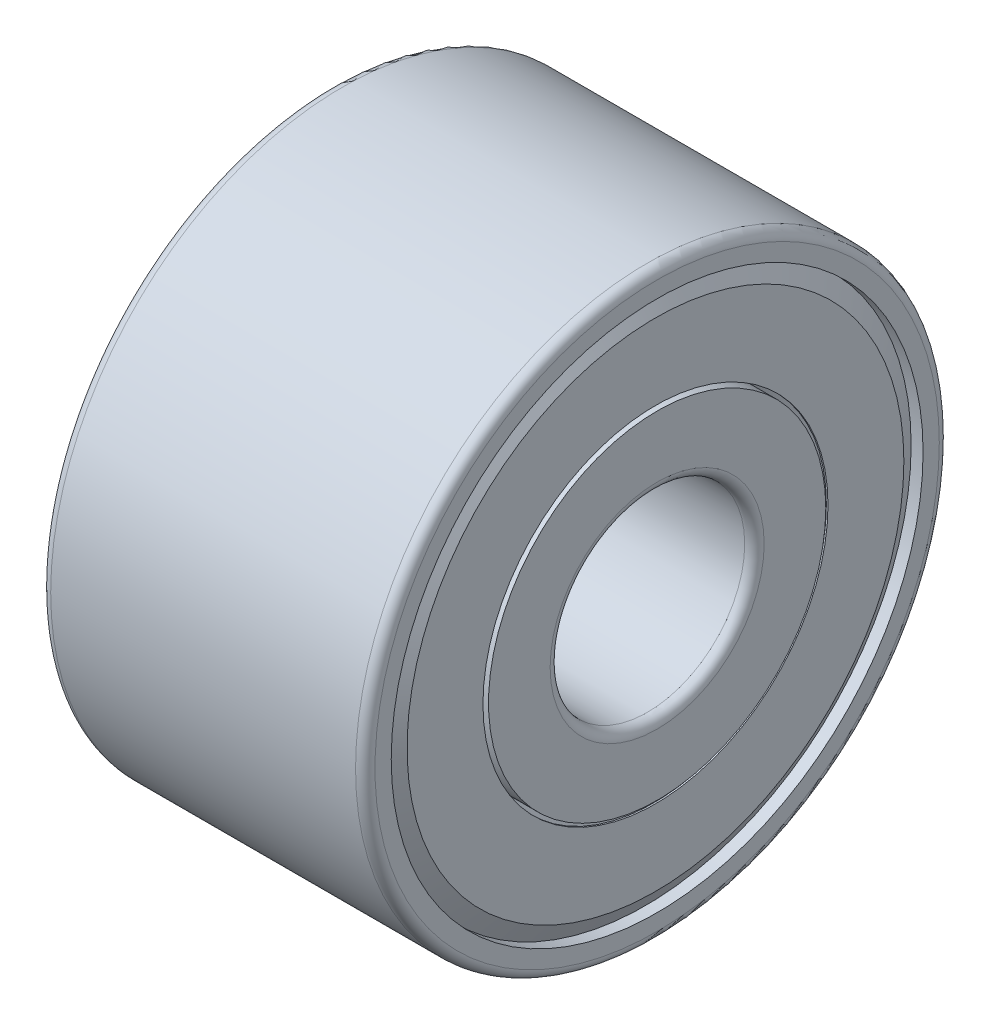
ISO-10303-21;
HEADER;
FILE_DESCRIPTION(('STEP AP214'),'2;1');
FILE_NAME('part.step','',(''),(''),'','','');
FILE_SCHEMA(('AUTOMOTIVE_DESIGN { 1 0 10303 214 1 1 1 1 }'));
ENDSEC;
DATA;
#1=APPLICATION_CONTEXT('core data for automotive mechanical design processes');
#2=APPLICATION_PROTOCOL_DEFINITION('international standard','automotive_design',2000,#1);
#3=PRODUCT_CONTEXT('',#1,'mechanical');
#4=PRODUCT('Part','Part','',(#3));
#5=PRODUCT_RELATED_PRODUCT_CATEGORY('part','',(#4));
#6=PRODUCT_DEFINITION_FORMATION('','',#4);
#7=PRODUCT_DEFINITION_CONTEXT('part definition',#1,'design');
#8=PRODUCT_DEFINITION('design','',#6,#7);
#9=PRODUCT_DEFINITION_SHAPE('','',#8);
#10=(LENGTH_UNIT() NAMED_UNIT(*) SI_UNIT(.MILLI.,.METRE.));
#11=(NAMED_UNIT(*) PLANE_ANGLE_UNIT() SI_UNIT($,.RADIAN.));
#12=(NAMED_UNIT(*) SI_UNIT($,.STERADIAN.) SOLID_ANGLE_UNIT());
#13=UNCERTAINTY_MEASURE_WITH_UNIT(LENGTH_MEASURE(1.E-05),#10,'distance_accuracy_value','');
#14=(GEOMETRIC_REPRESENTATION_CONTEXT(3) GLOBAL_UNCERTAINTY_ASSIGNED_CONTEXT((#13)) GLOBAL_UNIT_ASSIGNED_CONTEXT((#10,
#11,#12)) REPRESENTATION_CONTEXT('',''));
#15=CARTESIAN_POINT('',(0.,0.,0.));
#16=DIRECTION('',(0.,0.,1.));
#17=DIRECTION('',(1.,0.,0.));
#18=AXIS2_PLACEMENT_3D('',#15,#16,#17);
#19=CARTESIAN_POINT('',(4.,0.,0.));
#20=DIRECTION('',(-1.,0.,0.));
#21=DIRECTION('',(0.,0.,-1.));
#22=AXIS2_PLACEMENT_3D('',#19,#20,#21);
#23=CYLINDRICAL_SURFACE('',#22,2.6);
#24=CARTESIAN_POINT('',(4.,0.,0.));
#25=DIRECTION('',(1.,0.,0.));
#26=DIRECTION('',(0.,0.,-1.));
#27=AXIS2_PLACEMENT_3D('',#24,#25,#26);
#28=CIRCLE('',#27,2.6);
#29=CARTESIAN_POINT('',(4.,0.,-2.6));
#30=VERTEX_POINT('',#29);
#31=EDGE_CURVE('E10',#30,#30,#28,.T.);
#32=ORIENTED_EDGE('',*,*,#31,.F.);
#33=EDGE_LOOP('',(#32));
#34=FACE_BOUND('',#33,.T.);
#35=CARTESIAN_POINT('',(3.11246098558306,0.,0.));
#36=DIRECTION('',(1.,0.,0.));
#37=DIRECTION('',(0.,0.,-1.));
#38=AXIS2_PLACEMENT_3D('',#35,#36,#37);
#39=CIRCLE('',#38,2.6);
#40=CARTESIAN_POINT('',(3.11246098558306,0.,-2.6));
#41=VERTEX_POINT('',#40);
#42=EDGE_CURVE('E141',#41,#41,#39,.T.);
#43=ORIENTED_EDGE('',*,*,#42,.T.);
#44=EDGE_LOOP('',(#43));
#45=FACE_BOUND('',#44,.T.);
#46=ADVANCED_FACE('F35',(#34,#45),#23,.T.);
#47=CARTESIAN_POINT('',(4.,2.6,0.));
#48=DIRECTION('',(1.,0.,0.));
#49=DIRECTION('',(0.,0.,1.));
#50=AXIS2_PLACEMENT_3D('',#47,#48,#49);
#51=PLANE('',#50);
#52=CARTESIAN_POINT('',(4.,0.,0.));
#53=DIRECTION('',(1.,0.,0.));
#54=DIRECTION('',(0.,0.,-1.));
#55=AXIS2_PLACEMENT_3D('',#52,#53,#54);
#56=CIRCLE('',#55,1.65);
#57=CARTESIAN_POINT('',(4.,0.,-1.65));
#58=VERTEX_POINT('',#57);
#59=EDGE_CURVE('E41',#58,#58,#56,.T.);
#60=ORIENTED_EDGE('',*,*,#59,.F.);
#61=EDGE_LOOP('',(#60));
#62=FACE_BOUND('',#61,.T.);
#63=ORIENTED_EDGE('',*,*,#31,.T.);
#64=EDGE_LOOP('',(#63));
#65=FACE_BOUND('',#64,.T.);
#66=ADVANCED_FACE('F334',(#62,#65),#51,.T.);
#67=CARTESIAN_POINT('',(3.85,0.,0.));
#68=DIRECTION('',(-1.,0.,0.));
#69=DIRECTION('',(0.,0.,-1.));
#70=AXIS2_PLACEMENT_3D('',#67,#68,#69);
#71=TOROIDAL_SURFACE('',#70,1.65,0.15);
#72=CARTESIAN_POINT('',(3.85,0.,0.));
#73=DIRECTION('',(1.,0.,0.));
#74=DIRECTION('',(0.,0.,-1.));
#75=AXIS2_PLACEMENT_3D('',#72,#73,#74);
#76=CIRCLE('',#75,1.5);
#77=CARTESIAN_POINT('',(3.85,0.,-1.5));
#78=VERTEX_POINT('',#77);
#79=EDGE_CURVE('E45',#78,#78,#76,.T.);
#80=ORIENTED_EDGE('',*,*,#79,.F.);
#81=EDGE_LOOP('',(#80));
#82=FACE_BOUND('',#81,.T.);
#83=ORIENTED_EDGE('',*,*,#59,.T.);
#84=EDGE_LOOP('',(#83));
#85=FACE_BOUND('',#84,.T.);
#86=ADVANCED_FACE('F329',(#82,#85),#71,.T.);
#87=CARTESIAN_POINT('',(4.,0.,0.));
#88=DIRECTION('',(-1.,0.,0.));
#89=DIRECTION('',(0.,0.,-1.));
#90=AXIS2_PLACEMENT_3D('',#87,#88,#89);
#91=CYLINDRICAL_SURFACE('',#90,1.5);
#92=CARTESIAN_POINT('',(-0.85,0.,0.));
#93=DIRECTION('',(1.,0.,0.));
#94=DIRECTION('',(0.,0.,-1.));
#95=AXIS2_PLACEMENT_3D('',#92,#93,#94);
#96=CIRCLE('',#95,1.5);
#97=CARTESIAN_POINT('',(-0.85,0.,-1.5));
#98=VERTEX_POINT('',#97);
#99=EDGE_CURVE('E49',#98,#98,#96,.T.);
#100=ORIENTED_EDGE('',*,*,#99,.F.);
#101=EDGE_LOOP('',(#100));
#102=FACE_BOUND('',#101,.T.);
#103=ORIENTED_EDGE('',*,*,#79,.T.);
#104=EDGE_LOOP('',(#103));
#105=FACE_BOUND('',#104,.T.);
#106=ADVANCED_FACE('F323',(#102,#105),#91,.F.);
#107=CARTESIAN_POINT('',(-0.85,0.,0.));
#108=DIRECTION('',(-1.,0.,0.));
#109=DIRECTION('',(0.,0.,-1.));
#110=AXIS2_PLACEMENT_3D('',#107,#108,#109);
#111=TOROIDAL_SURFACE('',#110,1.65,0.15);
#112=CARTESIAN_POINT('',(-1.,0.,0.));
#113=DIRECTION('',(1.,0.,0.));
#114=DIRECTION('',(0.,0.,-1.));
#115=AXIS2_PLACEMENT_3D('',#112,#113,#114);
#116=CIRCLE('',#115,1.65);
#117=CARTESIAN_POINT('',(-1.,0.,-1.65));
#118=VERTEX_POINT('',#117);
#119=EDGE_CURVE('E54',#118,#118,#116,.T.);
#120=ORIENTED_EDGE('',*,*,#119,.F.);
#121=EDGE_LOOP('',(#120));
#122=FACE_BOUND('',#121,.T.);
#123=ORIENTED_EDGE('',*,*,#99,.T.);
#124=EDGE_LOOP('',(#123));
#125=FACE_BOUND('',#124,.T.);
#126=ADVANCED_FACE('F317',(#122,#125),#111,.T.);
#127=CARTESIAN_POINT('',(-1.,2.6,0.));
#128=DIRECTION('',(-1.,0.,0.));
#129=DIRECTION('',(0.,0.,-1.));
#130=AXIS2_PLACEMENT_3D('',#127,#128,#129);
#131=PLANE('',#130);
#132=CARTESIAN_POINT('',(-1.,0.,0.));
#133=DIRECTION('',(1.,0.,0.));
#134=DIRECTION('',(0.,0.,-1.));
#135=AXIS2_PLACEMENT_3D('',#132,#133,#134);
#136=CIRCLE('',#135,2.6);
#137=CARTESIAN_POINT('',(-1.,0.,-2.6));
#138=VERTEX_POINT('',#137);
#139=EDGE_CURVE('E57',#138,#138,#136,.T.);
#140=ORIENTED_EDGE('',*,*,#139,.F.);
#141=EDGE_LOOP('',(#140));
#142=FACE_BOUND('',#141,.T.);
#143=ORIENTED_EDGE('',*,*,#119,.T.);
#144=EDGE_LOOP('',(#143));
#145=FACE_BOUND('',#144,.T.);
#146=ADVANCED_FACE('F311',(#142,#145),#131,.T.);
#147=CARTESIAN_POINT('',(4.,0.,0.));
#148=DIRECTION('',(-1.,0.,0.));
#149=DIRECTION('',(0.,0.,-1.));
#150=AXIS2_PLACEMENT_3D('',#147,#148,#149);
#151=CYLINDRICAL_SURFACE('',#150,2.6);
#152=CARTESIAN_POINT('',(-0.112460985583064,0.,0.));
#153=DIRECTION('',(1.,0.,0.));
#154=DIRECTION('',(0.,0.,-1.));
#155=AXIS2_PLACEMENT_3D('',#152,#153,#154);
#156=CIRCLE('',#155,2.6);
#157=CARTESIAN_POINT('',(-0.112460985583064,0.,-2.6));
#158=VERTEX_POINT('',#157);
#159=EDGE_CURVE('E60',#158,#158,#156,.T.);
#160=ORIENTED_EDGE('',*,*,#159,.F.);
#161=EDGE_LOOP('',(#160));
#162=FACE_BOUND('',#161,.T.);
#163=ORIENTED_EDGE('',*,*,#139,.T.);
#164=EDGE_LOOP('',(#163));
#165=FACE_BOUND('',#164,.T.);
#166=ADVANCED_FACE('F305',(#162,#165),#151,.T.);
#167=CARTESIAN_POINT('',(1.,0.,0.));
#168=DIRECTION('',(-1.,0.,0.));
#169=DIRECTION('',(0.,0.,-1.));
#170=AXIS2_PLACEMENT_3D('',#167,#168,#169);
#171=TOROIDAL_SURFACE('',#170,3.35,1.34166666666667);
#172=CARTESIAN_POINT('',(-0.245017849046528,0.,0.));
#173=DIRECTION('',(1.,0.,0.));
#174=DIRECTION('',(0.,0.,-1.));
#175=AXIS2_PLACEMENT_3D('',#172,#173,#174);
#176=CIRCLE('',#175,3.85);
#177=CARTESIAN_POINT('',(-0.245017849046528,0.,-3.85));
#178=VERTEX_POINT('',#177);
#179=EDGE_CURVE('E63',#178,#178,#176,.T.);
#180=ORIENTED_EDGE('',*,*,#179,.F.);
#181=EDGE_LOOP('',(#180));
#182=FACE_BOUND('',#181,.T.);
#183=ORIENTED_EDGE('',*,*,#159,.T.);
#184=EDGE_LOOP('',(#183));
#185=FACE_BOUND('',#184,.T.);
#186=ADVANCED_FACE('F299',(#182,#185),#171,.T.);
#187=CARTESIAN_POINT('',(4.,0.,0.));
#188=DIRECTION('',(-1.,0.,0.));
#189=DIRECTION('',(0.,0.,-1.));
#190=AXIS2_PLACEMENT_3D('',#187,#188,#189);
#191=CYLINDRICAL_SURFACE('',#190,3.85);
#192=CARTESIAN_POINT('',(-0.636363636363635,0.,0.));
#193=DIRECTION('',(1.,0.,0.));
#194=DIRECTION('',(0.,0.,-1.));
#195=AXIS2_PLACEMENT_3D('',#192,#193,#194);
#196=CIRCLE('',#195,3.85);
#197=CARTESIAN_POINT('',(-0.636363636363635,0.,-3.85));
#198=VERTEX_POINT('',#197);
#199=EDGE_CURVE('E66',#198,#198,#196,.T.);
#200=ORIENTED_EDGE('',*,*,#199,.F.);
#201=EDGE_LOOP('',(#200));
#202=FACE_BOUND('',#201,.T.);
#203=ORIENTED_EDGE('',*,*,#179,.T.);
#204=EDGE_LOOP('',(#203));
#205=FACE_BOUND('',#204,.T.);
#206=ADVANCED_FACE('F293',(#202,#205),#191,.F.);
#207=CARTESIAN_POINT('',(-0.63636363636363,4.09999999999993,0.));
#208=DIRECTION('',(-1.,0.,0.));
#209=DIRECTION('',(0.,0.,-1.));
#210=AXIS2_PLACEMENT_3D('',#207,#208,#209);
#211=PLANE('',#210);
#212=CARTESIAN_POINT('',(-0.636363636363626,0.,0.));
#213=DIRECTION('',(1.,0.,0.));
#214=DIRECTION('',(0.,0.,-1.));
#215=AXIS2_PLACEMENT_3D('',#212,#213,#214);
#216=CIRCLE('',#215,4.09999999999993);
#217=CARTESIAN_POINT('',(-0.636363636363626,0.,-4.09999999999993));
#218=VERTEX_POINT('',#217);
#219=EDGE_CURVE('E69',#218,#218,#216,.T.);
#220=ORIENTED_EDGE('',*,*,#219,.F.);
#221=EDGE_LOOP('',(#220));
#222=FACE_BOUND('',#221,.T.);
#223=ORIENTED_EDGE('',*,*,#199,.T.);
#224=EDGE_LOOP('',(#223));
#225=FACE_BOUND('',#224,.T.);
#226=ADVANCED_FACE('F287',(#222,#225),#211,.T.);
#227=CARTESIAN_POINT('',(-0.727272727272719,0.,0.));
#228=DIRECTION('',(-1.,0.,0.));
#229=DIRECTION('',(0.,0.,-1.));
#230=AXIS2_PLACEMENT_3D('',#227,#228,#229);
#231=TOROIDAL_SURFACE('',#230,4.09999999999993,0.0909090909090932);
#232=CARTESIAN_POINT('',(-0.740980147437955,0.,0.));
#233=DIRECTION('',(1.,0.,0.));
#234=DIRECTION('',(0.,0.,-1.));
#235=AXIS2_PLACEMENT_3D('',#232,#233,#234);
#236=CIRCLE('',#235,4.18986973596444);
#237=CARTESIAN_POINT('',(-0.740980147437955,0.,-4.18986973596444));
#238=VERTEX_POINT('',#237);
#239=EDGE_CURVE('E72',#238,#238,#236,.T.);
#240=ORIENTED_EDGE('',*,*,#239,.F.);
#241=EDGE_LOOP('',(#240));
#242=FACE_BOUND('',#241,.T.);
#243=ORIENTED_EDGE('',*,*,#219,.T.);
#244=EDGE_LOOP('',(#243));
#245=FACE_BOUND('',#244,.T.);
#246=ADVANCED_FACE('F281',(#242,#245),#231,.F.);
#247=CARTESIAN_POINT('',(-0.740980147437955,0.,0.));
#248=DIRECTION('',(-1.,0.,0.));
#249=DIRECTION('',(0.,0.,-1.));
#250=AXIS2_PLACEMENT_3D('',#247,#248,#249);
#251=CONICAL_SURFACE('',#250,4.18986973596444,0.523598775598685);
#252=CARTESIAN_POINT('',(-0.738174682452694,0.,0.));
#253=DIRECTION('',(1.,0.,0.));
#254=DIRECTION('',(0.,0.,-1.));
#255=AXIS2_PLACEMENT_3D('',#252,#253,#254);
#256=CIRCLE('',#255,4.18825);
#257=CARTESIAN_POINT('',(-0.738174682452694,0.,-4.18825));
#258=VERTEX_POINT('',#257);
#259=EDGE_CURVE('E75',#258,#258,#256,.T.);
#260=ORIENTED_EDGE('',*,*,#259,.F.);
#261=EDGE_LOOP('',(#260));
#262=FACE_BOUND('',#261,.T.);
#263=ORIENTED_EDGE('',*,*,#239,.T.);
#264=EDGE_LOOP('',(#263));
#265=FACE_BOUND('',#264,.T.);
#266=ADVANCED_FACE('F275',(#262,#265),#251,.T.);
#267=CARTESIAN_POINT('',(-0.738174682452694,0.,0.));
#268=DIRECTION('',(1.,0.,0.));
#269=DIRECTION('',(0.,0.,1.));
#270=AXIS2_PLACEMENT_3D('',#267,#268,#269);
#271=CONICAL_SURFACE('',#270,4.18825,1.0471975511966);
#272=CARTESIAN_POINT('',(-0.949,0.,0.));
#273=DIRECTION('',(1.,0.,0.));
#274=DIRECTION('',(0.,0.,-1.));
#275=AXIS2_PLACEMENT_3D('',#272,#273,#274);
#276=CIRCLE('',#275,3.82308983848623);
#277=CARTESIAN_POINT('',(-0.949,0.,-3.82308983848623));
#278=VERTEX_POINT('',#277);
#279=EDGE_CURVE('E78',#278,#278,#276,.T.);
#280=ORIENTED_EDGE('',*,*,#279,.F.);
#281=EDGE_LOOP('',(#280));
#282=FACE_BOUND('',#281,.T.);
#283=ORIENTED_EDGE('',*,*,#259,.T.);
#284=EDGE_LOOP('',(#283));
#285=FACE_BOUND('',#284,.T.);
#286=ADVANCED_FACE('F269',(#282,#285),#271,.F.);
#287=CARTESIAN_POINT('',(-0.949,2.65999999999992,0.));
#288=DIRECTION('',(1.,0.,0.));
#289=DIRECTION('',(0.,0.,1.));
#290=AXIS2_PLACEMENT_3D('',#287,#288,#289);
#291=PLANE('',#290);
#292=CARTESIAN_POINT('',(-0.948999999999999,0.,0.));
#293=DIRECTION('',(1.,0.,0.));
#294=DIRECTION('',(0.,0.,-1.));
#295=AXIS2_PLACEMENT_3D('',#292,#293,#294);
#296=CIRCLE('',#295,2.65999999999992);
#297=CARTESIAN_POINT('',(-0.948999999999999,0.,-2.65999999999992));
#298=VERTEX_POINT('',#297);
#299=EDGE_CURVE('E81',#298,#298,#296,.T.);
#300=ORIENTED_EDGE('',*,*,#299,.F.);
#301=EDGE_LOOP('',(#300));
#302=FACE_BOUND('',#301,.T.);
#303=ORIENTED_EDGE('',*,*,#279,.T.);
#304=EDGE_LOOP('',(#303));
#305=FACE_BOUND('',#304,.T.);
#306=ADVANCED_FACE('F263',(#302,#305),#291,.T.);
#307=CARTESIAN_POINT('',(4.,0.,0.));
#308=DIRECTION('',(-1.,0.,0.));
#309=DIRECTION('',(0.,0.,-1.));
#310=AXIS2_PLACEMENT_3D('',#307,#308,#309);
#311=CYLINDRICAL_SURFACE('',#310,2.65999999999992);
#312=CARTESIAN_POINT('',(-0.973999999999983,0.,0.));
#313=DIRECTION('',(1.,0.,0.));
#314=DIRECTION('',(0.,0.,-1.));
#315=AXIS2_PLACEMENT_3D('',#312,#313,#314);
#316=CIRCLE('',#315,2.65999999999992);
#317=CARTESIAN_POINT('',(-0.973999999999983,0.,-2.65999999999992));
#318=VERTEX_POINT('',#317);
#319=EDGE_CURVE('E84',#318,#318,#316,.T.);
#320=ORIENTED_EDGE('',*,*,#319,.F.);
#321=EDGE_LOOP('',(#320));
#322=FACE_BOUND('',#321,.T.);
#323=ORIENTED_EDGE('',*,*,#299,.T.);
#324=EDGE_LOOP('',(#323));
#325=FACE_BOUND('',#324,.T.);
#326=ADVANCED_FACE('F257',(#322,#325),#311,.F.);
#327=CARTESIAN_POINT('',(-0.973999999999983,3.82978856829693,0.));
#328=DIRECTION('',(-1.,0.,0.));
#329=DIRECTION('',(0.,0.,-1.));
#330=AXIS2_PLACEMENT_3D('',#327,#328,#329);
#331=PLANE('',#330);
#332=CARTESIAN_POINT('',(-0.973999999999983,0.,0.));
#333=DIRECTION('',(1.,0.,0.));
#334=DIRECTION('',(0.,0.,-1.));
#335=AXIS2_PLACEMENT_3D('',#332,#333,#334);
#336=CIRCLE('',#335,3.82978856829693);
#337=CARTESIAN_POINT('',(-0.973999999999983,0.,-3.82978856829693));
#338=VERTEX_POINT('',#337);
#339=EDGE_CURVE('E87',#338,#338,#336,.T.);
#340=ORIENTED_EDGE('',*,*,#339,.F.);
#341=EDGE_LOOP('',(#340));
#342=FACE_BOUND('',#341,.T.);
#343=ORIENTED_EDGE('',*,*,#319,.T.);
#344=EDGE_LOOP('',(#343));
#345=FACE_BOUND('',#344,.T.);
#346=ADVANCED_FACE('F251',(#342,#345),#331,.T.);
#347=CARTESIAN_POINT('',(-0.973999999999983,0.,0.));
#348=DIRECTION('',(1.,0.,0.));
#349=DIRECTION('',(0.,0.,1.));
#350=AXIS2_PLACEMENT_3D('',#347,#348,#349);
#351=CONICAL_SURFACE('',#350,3.82978856829693,1.04117434780133);
#352=CARTESIAN_POINT('',(-0.81581570684173,0.,0.));
#353=DIRECTION('',(1.,0.,0.));
#354=DIRECTION('',(0.,0.,-1.));
#355=AXIS2_PLACEMENT_3D('',#352,#353,#354);
#356=CIRCLE('',#355,4.09999999999993);
#357=CARTESIAN_POINT('',(-0.81581570684173,0.,-4.09999999999993));
#358=VERTEX_POINT('',#357);
#359=EDGE_CURVE('E90',#358,#358,#356,.T.);
#360=ORIENTED_EDGE('',*,*,#359,.F.);
#361=EDGE_LOOP('',(#360));
#362=FACE_BOUND('',#361,.T.);
#363=ORIENTED_EDGE('',*,*,#339,.T.);
#364=EDGE_LOOP('',(#363));
#365=FACE_BOUND('',#364,.T.);
#366=ADVANCED_FACE('F245',(#362,#365),#351,.T.);
#367=CARTESIAN_POINT('',(4.,0.,0.));
#368=DIRECTION('',(-1.,0.,0.));
#369=DIRECTION('',(0.,0.,-1.));
#370=AXIS2_PLACEMENT_3D('',#367,#368,#369);
#371=CYLINDRICAL_SURFACE('',#370,4.09999999999993);
#372=CARTESIAN_POINT('',(-1.,0.,0.));
#373=DIRECTION('',(1.,0.,0.));
#374=DIRECTION('',(0.,0.,-1.));
#375=AXIS2_PLACEMENT_3D('',#372,#373,#374);
#376=CIRCLE('',#375,4.09999999999993);
#377=CARTESIAN_POINT('',(-1.,0.,-4.09999999999993));
#378=VERTEX_POINT('',#377);
#379=EDGE_CURVE('E93',#378,#378,#376,.T.);
#380=ORIENTED_EDGE('',*,*,#379,.F.);
#381=EDGE_LOOP('',(#380));
#382=FACE_BOUND('',#381,.T.);
#383=ORIENTED_EDGE('',*,*,#359,.T.);
#384=EDGE_LOOP('',(#383));
#385=FACE_BOUND('',#384,.T.);
#386=ADVANCED_FACE('F239',(#382,#385),#371,.F.);
#387=CARTESIAN_POINT('',(-1.,4.35,0.));
#388=DIRECTION('',(-1.,0.,0.));
#389=DIRECTION('',(0.,0.,-1.));
#390=AXIS2_PLACEMENT_3D('',#387,#388,#389);
#391=PLANE('',#390);
#392=CARTESIAN_POINT('',(-1.,0.,0.));
#393=DIRECTION('',(1.,0.,0.));
#394=DIRECTION('',(0.,0.,-1.));
#395=AXIS2_PLACEMENT_3D('',#392,#393,#394);
#396=CIRCLE('',#395,4.35);
#397=CARTESIAN_POINT('',(-1.,0.,-4.35));
#398=VERTEX_POINT('',#397);
#399=EDGE_CURVE('E96',#398,#398,#396,.T.);
#400=ORIENTED_EDGE('',*,*,#399,.F.);
#401=EDGE_LOOP('',(#400));
#402=FACE_BOUND('',#401,.T.);
#403=ORIENTED_EDGE('',*,*,#379,.T.);
#404=EDGE_LOOP('',(#403));
#405=FACE_BOUND('',#404,.T.);
#406=ADVANCED_FACE('F233',(#402,#405),#391,.T.);
#407=CARTESIAN_POINT('',(-0.85,0.,0.));
#408=DIRECTION('',(-1.,0.,0.));
#409=DIRECTION('',(0.,0.,-1.));
#410=AXIS2_PLACEMENT_3D('',#407,#408,#409);
#411=TOROIDAL_SURFACE('',#410,4.35,0.15);
#412=CARTESIAN_POINT('',(-0.85,0.,0.));
#413=DIRECTION('',(1.,0.,0.));
#414=DIRECTION('',(0.,0.,-1.));
#415=AXIS2_PLACEMENT_3D('',#412,#413,#414);
#416=CIRCLE('',#415,4.5);
#417=CARTESIAN_POINT('',(-0.85,0.,-4.5));
#418=VERTEX_POINT('',#417);
#419=EDGE_CURVE('E99',#418,#418,#416,.T.);
#420=ORIENTED_EDGE('',*,*,#419,.F.);
#421=EDGE_LOOP('',(#420));
#422=FACE_BOUND('',#421,.T.);
#423=ORIENTED_EDGE('',*,*,#399,.T.);
#424=EDGE_LOOP('',(#423));
#425=FACE_BOUND('',#424,.T.);
#426=ADVANCED_FACE('F227',(#422,#425),#411,.T.);
#427=CARTESIAN_POINT('',(4.,0.,0.));
#428=DIRECTION('',(-1.,0.,0.));
#429=DIRECTION('',(0.,0.,-1.));
#430=AXIS2_PLACEMENT_3D('',#427,#428,#429);
#431=CYLINDRICAL_SURFACE('',#430,4.5);
#432=CARTESIAN_POINT('',(3.85,0.,0.));
#433=DIRECTION('',(1.,0.,0.));
#434=DIRECTION('',(0.,0.,-1.));
#435=AXIS2_PLACEMENT_3D('',#432,#433,#434);
#436=CIRCLE('',#435,4.5);
#437=CARTESIAN_POINT('',(3.85,0.,-4.5));
#438=VERTEX_POINT('',#437);
#439=EDGE_CURVE('E102',#438,#438,#436,.T.);
#440=ORIENTED_EDGE('',*,*,#439,.F.);
#441=EDGE_LOOP('',(#440));
#442=FACE_BOUND('',#441,.T.);
#443=ORIENTED_EDGE('',*,*,#419,.T.);
#444=EDGE_LOOP('',(#443));
#445=FACE_BOUND('',#444,.T.);
#446=ADVANCED_FACE('F221',(#442,#445),#431,.T.);
#447=CARTESIAN_POINT('',(3.85,0.,0.));
#448=DIRECTION('',(-1.,0.,0.));
#449=DIRECTION('',(0.,0.,-1.));
#450=AXIS2_PLACEMENT_3D('',#447,#448,#449);
#451=TOROIDAL_SURFACE('',#450,4.35,0.15);
#452=CARTESIAN_POINT('',(4.,0.,0.));
#453=DIRECTION('',(1.,0.,0.));
#454=DIRECTION('',(0.,0.,-1.));
#455=AXIS2_PLACEMENT_3D('',#452,#453,#454);
#456=CIRCLE('',#455,4.35);
#457=CARTESIAN_POINT('',(4.,0.,-4.35));
#458=VERTEX_POINT('',#457);
#459=EDGE_CURVE('E105',#458,#458,#456,.T.);
#460=ORIENTED_EDGE('',*,*,#459,.F.);
#461=EDGE_LOOP('',(#460));
#462=FACE_BOUND('',#461,.T.);
#463=ORIENTED_EDGE('',*,*,#439,.T.);
#464=EDGE_LOOP('',(#463));
#465=FACE_BOUND('',#464,.T.);
#466=ADVANCED_FACE('F215',(#462,#465),#451,.T.);
#467=CARTESIAN_POINT('',(4.,4.35,0.));
#468=DIRECTION('',(1.,0.,0.));
#469=DIRECTION('',(0.,0.,1.));
#470=AXIS2_PLACEMENT_3D('',#467,#468,#469);
#471=PLANE('',#470);
#472=CARTESIAN_POINT('',(4.,0.,0.));
#473=DIRECTION('',(1.,0.,0.));
#474=DIRECTION('',(0.,0.,-1.));
#475=AXIS2_PLACEMENT_3D('',#472,#473,#474);
#476=CIRCLE('',#475,4.09999999999993);
#477=CARTESIAN_POINT('',(4.,0.,-4.09999999999993));
#478=VERTEX_POINT('',#477);
#479=EDGE_CURVE('E108',#478,#478,#476,.T.);
#480=ORIENTED_EDGE('',*,*,#479,.F.);
#481=EDGE_LOOP('',(#480));
#482=FACE_BOUND('',#481,.T.);
#483=ORIENTED_EDGE('',*,*,#459,.T.);
#484=EDGE_LOOP('',(#483));
#485=FACE_BOUND('',#484,.T.);
#486=ADVANCED_FACE('F209',(#482,#485),#471,.T.);
#487=CARTESIAN_POINT('',(4.,0.,0.));
#488=DIRECTION('',(-1.,0.,0.));
#489=DIRECTION('',(0.,0.,-1.));
#490=AXIS2_PLACEMENT_3D('',#487,#488,#489);
#491=CYLINDRICAL_SURFACE('',#490,4.09999999999993);
#492=CARTESIAN_POINT('',(3.81581570684173,0.,0.));
#493=DIRECTION('',(1.,0.,0.));
#494=DIRECTION('',(0.,0.,-1.));
#495=AXIS2_PLACEMENT_3D('',#492,#493,#494);
#496=CIRCLE('',#495,4.09999999999993);
#497=CARTESIAN_POINT('',(3.81581570684173,0.,-4.09999999999993));
#498=VERTEX_POINT('',#497);
#499=EDGE_CURVE('E111',#498,#498,#496,.T.);
#500=ORIENTED_EDGE('',*,*,#499,.F.);
#501=EDGE_LOOP('',(#500));
#502=FACE_BOUND('',#501,.T.);
#503=ORIENTED_EDGE('',*,*,#479,.T.);
#504=EDGE_LOOP('',(#503));
#505=FACE_BOUND('',#504,.T.);
#506=ADVANCED_FACE('F203',(#502,#505),#491,.F.);
#507=CARTESIAN_POINT('',(3.81581570684173,0.,0.));
#508=DIRECTION('',(-1.,0.,0.));
#509=DIRECTION('',(0.,0.,-1.));
#510=AXIS2_PLACEMENT_3D('',#507,#508,#509);
#511=CONICAL_SURFACE('',#510,4.09999999999993,1.04117434780133);
#512=CARTESIAN_POINT('',(3.97399999999998,0.,0.));
#513=DIRECTION('',(1.,0.,0.));
#514=DIRECTION('',(0.,0.,-1.));
#515=AXIS2_PLACEMENT_3D('',#512,#513,#514);
#516=CIRCLE('',#515,3.82978856829693);
#517=CARTESIAN_POINT('',(3.97399999999998,0.,-3.82978856829693));
#518=VERTEX_POINT('',#517);
#519=EDGE_CURVE('E114',#518,#518,#516,.T.);
#520=ORIENTED_EDGE('',*,*,#519,.F.);
#521=EDGE_LOOP('',(#520));
#522=FACE_BOUND('',#521,.T.);
#523=ORIENTED_EDGE('',*,*,#499,.T.);
#524=EDGE_LOOP('',(#523));
#525=FACE_BOUND('',#524,.T.);
#526=ADVANCED_FACE('F197',(#522,#525),#511,.T.);
#527=CARTESIAN_POINT('',(3.97399999999998,3.82978856829693,0.));
#528=DIRECTION('',(1.,0.,0.));
#529=DIRECTION('',(0.,0.,1.));
#530=AXIS2_PLACEMENT_3D('',#527,#528,#529);
#531=PLANE('',#530);
#532=CARTESIAN_POINT('',(3.97399999999998,0.,0.));
#533=DIRECTION('',(1.,0.,0.));
#534=DIRECTION('',(0.,0.,-1.));
#535=AXIS2_PLACEMENT_3D('',#532,#533,#534);
#536=CIRCLE('',#535,2.65999999999992);
#537=CARTESIAN_POINT('',(3.97399999999998,0.,-2.65999999999992));
#538=VERTEX_POINT('',#537);
#539=EDGE_CURVE('E117',#538,#538,#536,.T.);
#540=ORIENTED_EDGE('',*,*,#539,.F.);
#541=EDGE_LOOP('',(#540));
#542=FACE_BOUND('',#541,.T.);
#543=ORIENTED_EDGE('',*,*,#519,.T.);
#544=EDGE_LOOP('',(#543));
#545=FACE_BOUND('',#544,.T.);
#546=ADVANCED_FACE('F191',(#542,#545),#531,.T.);
#547=CARTESIAN_POINT('',(4.,0.,0.));
#548=DIRECTION('',(-1.,0.,0.));
#549=DIRECTION('',(0.,0.,-1.));
#550=AXIS2_PLACEMENT_3D('',#547,#548,#549);
#551=CYLINDRICAL_SURFACE('',#550,2.65999999999992);
#552=CARTESIAN_POINT('',(3.949,0.,0.));
#553=DIRECTION('',(1.,0.,0.));
#554=DIRECTION('',(0.,0.,-1.));
#555=AXIS2_PLACEMENT_3D('',#552,#553,#554);
#556=CIRCLE('',#555,2.65999999999992);
#557=CARTESIAN_POINT('',(3.949,0.,-2.65999999999992));
#558=VERTEX_POINT('',#557);
#559=EDGE_CURVE('E120',#558,#558,#556,.T.);
#560=ORIENTED_EDGE('',*,*,#559,.F.);
#561=EDGE_LOOP('',(#560));
#562=FACE_BOUND('',#561,.T.);
#563=ORIENTED_EDGE('',*,*,#539,.T.);
#564=EDGE_LOOP('',(#563));
#565=FACE_BOUND('',#564,.T.);
#566=ADVANCED_FACE('F185',(#562,#565),#551,.F.);
#567=CARTESIAN_POINT('',(3.949,2.65999999999992,0.));
#568=DIRECTION('',(-1.,0.,0.));
#569=DIRECTION('',(0.,0.,-1.));
#570=AXIS2_PLACEMENT_3D('',#567,#568,#569);
#571=PLANE('',#570);
#572=CARTESIAN_POINT('',(3.949,0.,0.));
#573=DIRECTION('',(1.,0.,0.));
#574=DIRECTION('',(0.,0.,-1.));
#575=AXIS2_PLACEMENT_3D('',#572,#573,#574);
#576=CIRCLE('',#575,3.82308983848623);
#577=CARTESIAN_POINT('',(3.949,0.,-3.82308983848623));
#578=VERTEX_POINT('',#577);
#579=EDGE_CURVE('E123',#578,#578,#576,.T.);
#580=ORIENTED_EDGE('',*,*,#579,.F.);
#581=EDGE_LOOP('',(#580));
#582=FACE_BOUND('',#581,.T.);
#583=ORIENTED_EDGE('',*,*,#559,.T.);
#584=EDGE_LOOP('',(#583));
#585=FACE_BOUND('',#584,.T.);
#586=ADVANCED_FACE('F179',(#582,#585),#571,.T.);
#587=CARTESIAN_POINT('',(3.949,0.,0.));
#588=DIRECTION('',(-1.,0.,0.));
#589=DIRECTION('',(0.,0.,-1.));
#590=AXIS2_PLACEMENT_3D('',#587,#588,#589);
#591=CONICAL_SURFACE('',#590,3.82308983848623,1.0471975511966);
#592=CARTESIAN_POINT('',(3.7381746824527,0.,0.));
#593=DIRECTION('',(1.,0.,0.));
#594=DIRECTION('',(0.,0.,-1.));
#595=AXIS2_PLACEMENT_3D('',#592,#593,#594);
#596=CIRCLE('',#595,4.18825);
#597=CARTESIAN_POINT('',(3.7381746824527,0.,-4.18825));
#598=VERTEX_POINT('',#597);
#599=EDGE_CURVE('E126',#598,#598,#596,.T.);
#600=ORIENTED_EDGE('',*,*,#599,.F.);
#601=EDGE_LOOP('',(#600));
#602=FACE_BOUND('',#601,.T.);
#603=ORIENTED_EDGE('',*,*,#579,.T.);
#604=EDGE_LOOP('',(#603));
#605=FACE_BOUND('',#604,.T.);
#606=ADVANCED_FACE('F173',(#602,#605),#591,.F.);
#607=CARTESIAN_POINT('',(3.7381746824527,0.,0.));
#608=DIRECTION('',(1.,0.,0.));
#609=DIRECTION('',(0.,0.,1.));
#610=AXIS2_PLACEMENT_3D('',#607,#608,#609);
#611=CONICAL_SURFACE('',#610,4.18825,0.52359877559852);
#612=CARTESIAN_POINT('',(3.74098014743795,0.,0.));
#613=DIRECTION('',(1.,0.,0.));
#614=DIRECTION('',(0.,0.,-1.));
#615=AXIS2_PLACEMENT_3D('',#612,#613,#614);
#616=CIRCLE('',#615,4.18986973596444);
#617=CARTESIAN_POINT('',(3.74098014743795,0.,-4.18986973596444));
#618=VERTEX_POINT('',#617);
#619=EDGE_CURVE('E129',#618,#618,#616,.T.);
#620=ORIENTED_EDGE('',*,*,#619,.F.);
#621=EDGE_LOOP('',(#620));
#622=FACE_BOUND('',#621,.T.);
#623=ORIENTED_EDGE('',*,*,#599,.T.);
#624=EDGE_LOOP('',(#623));
#625=FACE_BOUND('',#624,.T.);
#626=ADVANCED_FACE('F167',(#622,#625),#611,.T.);
#627=CARTESIAN_POINT('',(3.72727272727272,0.,0.));
#628=DIRECTION('',(-1.,0.,0.));
#629=DIRECTION('',(0.,0.,-1.));
#630=AXIS2_PLACEMENT_3D('',#627,#628,#629);
#631=TOROIDAL_SURFACE('',#630,4.09999999999993,0.0909090909090932);
#632=CARTESIAN_POINT('',(3.63636363636363,0.,0.));
#633=DIRECTION('',(1.,0.,0.));
#634=DIRECTION('',(0.,0.,-1.));
#635=AXIS2_PLACEMENT_3D('',#632,#633,#634);
#636=CIRCLE('',#635,4.09999999999993);
#637=CARTESIAN_POINT('',(3.63636363636363,0.,-4.09999999999993));
#638=VERTEX_POINT('',#637);
#639=EDGE_CURVE('E132',#638,#638,#636,.T.);
#640=ORIENTED_EDGE('',*,*,#639,.F.);
#641=EDGE_LOOP('',(#640));
#642=FACE_BOUND('',#641,.T.);
#643=ORIENTED_EDGE('',*,*,#619,.T.);
#644=EDGE_LOOP('',(#643));
#645=FACE_BOUND('',#644,.T.);
#646=ADVANCED_FACE('F161',(#642,#645),#631,.F.);
#647=CARTESIAN_POINT('',(3.63636363636363,4.09999999999993,0.));
#648=DIRECTION('',(1.,0.,0.));
#649=DIRECTION('',(0.,0.,1.));
#650=AXIS2_PLACEMENT_3D('',#647,#648,#649);
#651=PLANE('',#650);
#652=CARTESIAN_POINT('',(3.63636363636363,0.,0.));
#653=DIRECTION('',(1.,0.,0.));
#654=DIRECTION('',(0.,0.,-1.));
#655=AXIS2_PLACEMENT_3D('',#652,#653,#654);
#656=CIRCLE('',#655,3.85);
#657=CARTESIAN_POINT('',(3.63636363636363,0.,-3.85));
#658=VERTEX_POINT('',#657);
#659=EDGE_CURVE('E135',#658,#658,#656,.T.);
#660=ORIENTED_EDGE('',*,*,#659,.F.);
#661=EDGE_LOOP('',(#660));
#662=FACE_BOUND('',#661,.T.);
#663=ORIENTED_EDGE('',*,*,#639,.T.);
#664=EDGE_LOOP('',(#663));
#665=FACE_BOUND('',#664,.T.);
#666=ADVANCED_FACE('F155',(#662,#665),#651,.T.);
#667=CARTESIAN_POINT('',(4.,0.,0.));
#668=DIRECTION('',(-1.,0.,0.));
#669=DIRECTION('',(0.,0.,-1.));
#670=AXIS2_PLACEMENT_3D('',#667,#668,#669);
#671=CYLINDRICAL_SURFACE('',#670,3.85);
#672=CARTESIAN_POINT('',(3.24501784904653,0.,0.));
#673=DIRECTION('',(1.,0.,0.));
#674=DIRECTION('',(0.,0.,-1.));
#675=AXIS2_PLACEMENT_3D('',#672,#673,#674);
#676=CIRCLE('',#675,3.85);
#677=CARTESIAN_POINT('',(3.24501784904653,0.,-3.85));
#678=VERTEX_POINT('',#677);
#679=EDGE_CURVE('E138',#678,#678,#676,.T.);
#680=ORIENTED_EDGE('',*,*,#679,.F.);
#681=EDGE_LOOP('',(#680));
#682=FACE_BOUND('',#681,.T.);
#683=ORIENTED_EDGE('',*,*,#659,.T.);
#684=EDGE_LOOP('',(#683));
#685=FACE_BOUND('',#684,.T.);
#686=ADVANCED_FACE('F149',(#682,#685),#671,.F.);
#687=CARTESIAN_POINT('',(2.,0.,0.));
#688=DIRECTION('',(-1.,0.,0.));
#689=DIRECTION('',(0.,0.,-1.));
#690=AXIS2_PLACEMENT_3D('',#687,#688,#689);
#691=TOROIDAL_SURFACE('',#690,3.35,1.34166666666667);
#692=ORIENTED_EDGE('',*,*,#42,.F.);
#693=EDGE_LOOP('',(#692));
#694=FACE_BOUND('',#693,.T.);
#695=ORIENTED_EDGE('',*,*,#679,.T.);
#696=EDGE_LOOP('',(#695));
#697=FACE_BOUND('',#696,.T.);
#698=ADVANCED_FACE('F146',(#694,#697),#691,.T.);
#699=CLOSED_SHELL('',(#46,#66,#86,#106,#126,#146,#166,#186,#206,#226,#246,#266,#286,#306,#326,
#346,#366,#386,#406,#426,#446,#466,#486,#506,#526,#546,#566,#586,#606,#626,#646,#666,#686,#698));
#700=MANIFOLD_SOLID_BREP('B2',#699);
#701=ADVANCED_BREP_SHAPE_REPRESENTATION('',(#18,#700),#14);
#702=SHAPE_DEFINITION_REPRESENTATION(#9,#701);
ENDSEC;
END-ISO-10303-21;
